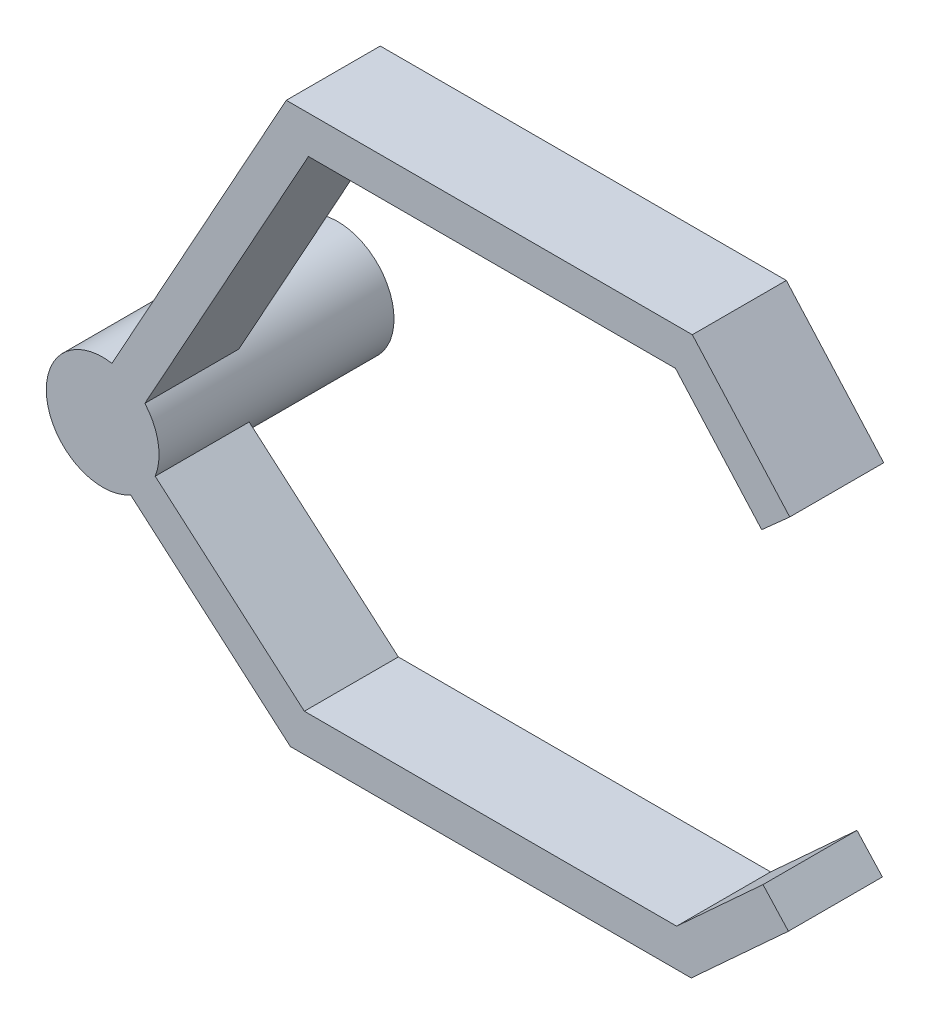
ISO-10303-21;
HEADER;
FILE_DESCRIPTION(('STEP AP214'),'2;1');
FILE_NAME('part.step','',(''),(''),'','','');
FILE_SCHEMA(('AUTOMOTIVE_DESIGN { 1 0 10303 214 1 1 1 1 }'));
ENDSEC;
DATA;
#1=APPLICATION_CONTEXT('core data for automotive mechanical design processes');
#2=APPLICATION_PROTOCOL_DEFINITION('international standard','automotive_design',2000,#1);
#3=PRODUCT_CONTEXT('',#1,'mechanical');
#4=PRODUCT('Part','Part','',(#3));
#5=PRODUCT_RELATED_PRODUCT_CATEGORY('part','',(#4));
#6=PRODUCT_DEFINITION_FORMATION('','',#4);
#7=PRODUCT_DEFINITION_CONTEXT('part definition',#1,'design');
#8=PRODUCT_DEFINITION('design','',#6,#7);
#9=PRODUCT_DEFINITION_SHAPE('','',#8);
#10=(LENGTH_UNIT() NAMED_UNIT(*) SI_UNIT(.MILLI.,.METRE.));
#11=(NAMED_UNIT(*) PLANE_ANGLE_UNIT() SI_UNIT($,.RADIAN.));
#12=(NAMED_UNIT(*) SI_UNIT($,.STERADIAN.) SOLID_ANGLE_UNIT());
#13=UNCERTAINTY_MEASURE_WITH_UNIT(LENGTH_MEASURE(1.E-05),#10,'distance_accuracy_value','');
#14=(GEOMETRIC_REPRESENTATION_CONTEXT(3) GLOBAL_UNCERTAINTY_ASSIGNED_CONTEXT((#13)) GLOBAL_UNIT_ASSIGNED_CONTEXT((#10,
#11,#12)) REPRESENTATION_CONTEXT('',''));
#15=CARTESIAN_POINT('',(0.,0.,0.));
#16=DIRECTION('',(0.,0.,1.));
#17=DIRECTION('',(1.,0.,0.));
#18=AXIS2_PLACEMENT_3D('',#15,#16,#17);
#19=CARTESIAN_POINT('',(0.,0.,-15.));
#20=DIRECTION('',(0.,0.,1.));
#21=DIRECTION('',(1.,0.,0.));
#22=AXIS2_PLACEMENT_3D('',#19,#20,#21);
#23=CYLINDRICAL_SURFACE('',#22,6.);
#24=CARTESIAN_POINT('',(0.,0.,-15.));
#25=DIRECTION('',(0.,0.,1.));
#26=DIRECTION('',(1.,0.,0.));
#27=AXIS2_PLACEMENT_3D('',#24,#25,#26);
#28=CIRCLE('',#27,6.);
#29=CARTESIAN_POINT('',(6.,0.,-15.));
#30=VERTEX_POINT('',#29);
#31=EDGE_CURVE('E241',#30,#30,#28,.T.);
#32=ORIENTED_EDGE('',*,*,#31,.T.);
#33=EDGE_LOOP('',(#32));
#34=FACE_BOUND('',#33,.T.);
#35=CARTESIAN_POINT('',(0.,0.,0.));
#36=DIRECTION('',(0.,0.,1.));
#37=DIRECTION('',(1.,0.,0.));
#38=AXIS2_PLACEMENT_3D('',#35,#36,#37);
#39=CIRCLE('',#38,6.);
#40=CARTESIAN_POINT('',(2.97205993748859,-5.21218377726412,0.));
#41=VERTEX_POINT('',#40);
#42=CARTESIAN_POINT('',(5.58766483466355,-2.1858640615245,0.));
#43=VERTEX_POINT('',#42);
#44=EDGE_CURVE('E363',#41,#43,#39,.T.);
#45=ORIENTED_EDGE('',*,*,#44,.F.);
#46=DIRECTION('',(0.,0.,-1.));
#47=VECTOR('',#46,1.);
#48=CARTESIAN_POINT('',(2.97205993748859,-5.21218377726413,10.));
#49=LINE('',#48,#47);
#50=CARTESIAN_POINT('',(2.97205993748859,-5.21218377726413,10.));
#51=VERTEX_POINT('',#50);
#52=EDGE_CURVE('E304',#51,#41,#49,.T.);
#53=ORIENTED_EDGE('',*,*,#52,.F.);
#54=CARTESIAN_POINT('',(0.,0.,10.));
#55=DIRECTION('',(0.,0.,1.));
#56=DIRECTION('',(1.,0.,0.));
#57=AXIS2_PLACEMENT_3D('',#54,#55,#56);
#58=CIRCLE('',#57,6.);
#59=CARTESIAN_POINT('',(0.988958707477526,5.91793550783585,10.));
#60=VERTEX_POINT('',#59);
#61=EDGE_CURVE('E296',#60,#51,#58,.T.);
#62=ORIENTED_EDGE('',*,*,#61,.F.);
#63=DIRECTION('',(0.,0.,-1.));
#64=VECTOR('',#63,1.);
#65=CARTESIAN_POINT('',(0.988958707477526,5.91793550783585,10.));
#66=LINE('',#65,#64);
#67=CARTESIAN_POINT('',(0.988958707477526,5.91793550783585,0.));
#68=VERTEX_POINT('',#67);
#69=EDGE_CURVE('E181',#60,#68,#66,.T.);
#70=ORIENTED_EDGE('',*,*,#69,.T.);
#71=CARTESIAN_POINT('',(0.,0.,0.));
#72=DIRECTION('',(0.,0.,1.));
#73=DIRECTION('',(1.,0.,0.));
#74=AXIS2_PLACEMENT_3D('',#71,#72,#73);
#75=CIRCLE('',#74,6.);
#76=CARTESIAN_POINT('',(4.48884550867397,3.98123925420936,0.));
#77=VERTEX_POINT('',#76);
#78=EDGE_CURVE('E237',#77,#68,#75,.T.);
#79=ORIENTED_EDGE('',*,*,#78,.F.);
#80=DIRECTION('',(0.,0.,-1.));
#81=VECTOR('',#80,1.);
#82=CARTESIAN_POINT('',(4.48884550867397,3.98123925420936,10.));
#83=LINE('',#82,#81);
#84=CARTESIAN_POINT('',(4.48884550867397,3.98123925420936,10.));
#85=VERTEX_POINT('',#84);
#86=EDGE_CURVE('E12',#85,#77,#83,.T.);
#87=ORIENTED_EDGE('',*,*,#86,.F.);
#88=CARTESIAN_POINT('',(5.58766483466355,-2.1858640615245,10.));
#89=VERTEX_POINT('',#88);
#90=EDGE_CURVE('E300',#89,#85,#58,.T.);
#91=ORIENTED_EDGE('',*,*,#90,.F.);
#92=DIRECTION('',(0.,0.,-1.));
#93=VECTOR('',#92,1.);
#94=CARTESIAN_POINT('',(5.58766483466355,-2.1858640615245,10.));
#95=LINE('',#94,#93);
#96=EDGE_CURVE('E331',#89,#43,#95,.T.);
#97=ORIENTED_EDGE('',*,*,#96,.T.);
#98=EDGE_LOOP('',(#45,#53,#62,#70,#79,#87,#91,#97));
#99=FACE_BOUND('',#98,.T.);
#100=ADVANCED_FACE('F125',(#34,#99),#23,.T.);
#101=CARTESIAN_POINT('',(1.74994340059822,-0.968348126813247,10.));
#102=DIRECTION('',(-0.874971700299112,0.484174063406623,0.));
#103=DIRECTION('',(-0.484174063406623,-0.874971700299112,0.));
#104=AXIS2_PLACEMENT_3D('',#101,#102,#103);
#105=PLANE('',#104);
#106=DIRECTION('',(0.484174063406623,0.874971700299112,0.));
#107=VECTOR('',#106,1.);
#108=CARTESIAN_POINT('',(1.74994340059822,-0.968348126813247,0.));
#109=LINE('',#108,#107);
#110=CARTESIAN_POINT('',(21.8940701741508,35.4349666853925,0.));
#111=VERTEX_POINT('',#110);
#112=EDGE_CURVE('E240',#77,#111,#109,.T.);
#113=ORIENTED_EDGE('',*,*,#112,.T.);
#114=DIRECTION('',(0.,0.,-1.));
#115=VECTOR('',#114,1.);
#116=CARTESIAN_POINT('',(21.8940701741508,35.4349666853925,10.));
#117=LINE('',#116,#115);
#118=CARTESIAN_POINT('',(21.8940701741508,35.4349666853925,10.));
#119=VERTEX_POINT('',#118);
#120=EDGE_CURVE('E134',#119,#111,#117,.T.);
#121=ORIENTED_EDGE('',*,*,#120,.F.);
#122=DIRECTION('',(0.484174063406623,0.874971700299112,0.));
#123=VECTOR('',#122,1.);
#124=CARTESIAN_POINT('',(1.74994340059822,-0.968348126813247,10.));
#125=LINE('',#124,#123);
#126=EDGE_CURVE('E190',#85,#119,#125,.T.);
#127=ORIENTED_EDGE('',*,*,#126,.F.);
#128=ORIENTED_EDGE('',*,*,#86,.T.);
#129=EDGE_LOOP('',(#113,#121,#127,#128));
#130=FACE_BOUND('',#129,.T.);
#131=ADVANCED_FACE('F127',(#130),#105,.F.);
#132=CARTESIAN_POINT('',(0.,35.4349666853925,10.));
#133=DIRECTION('',(0.,1.,0.));
#134=DIRECTION('',(0.,0.,1.));
#135=AXIS2_PLACEMENT_3D('',#132,#133,#134);
#136=PLANE('',#135);
#137=DIRECTION('',(1.,0.,0.));
#138=VECTOR('',#137,1.);
#139=CARTESIAN_POINT('',(0.,35.4349666853925,0.));
#140=LINE('',#139,#138);
#141=CARTESIAN_POINT('',(60.9529553378539,35.4349666853925,0.));
#142=VERTEX_POINT('',#141);
#143=EDGE_CURVE('E244',#111,#142,#140,.T.);
#144=ORIENTED_EDGE('',*,*,#143,.T.);
#145=DIRECTION('',(0.,0.,-1.));
#146=VECTOR('',#145,1.);
#147=CARTESIAN_POINT('',(60.9529553378539,35.4349666853925,10.));
#148=LINE('',#147,#146);
#149=CARTESIAN_POINT('',(60.9529553378539,35.4349666853925,10.));
#150=VERTEX_POINT('',#149);
#151=EDGE_CURVE('E272',#150,#142,#148,.T.);
#152=ORIENTED_EDGE('',*,*,#151,.F.);
#153=DIRECTION('',(1.,0.,0.));
#154=VECTOR('',#153,1.);
#155=CARTESIAN_POINT('',(0.,35.4349666853925,10.));
#156=LINE('',#155,#154);
#157=EDGE_CURVE('E282',#119,#150,#156,.T.);
#158=ORIENTED_EDGE('',*,*,#157,.F.);
#159=ORIENTED_EDGE('',*,*,#120,.T.);
#160=EDGE_LOOP('',(#144,#152,#158,#159));
#161=FACE_BOUND('',#160,.T.);
#162=ADVANCED_FACE('F280',(#161),#136,.F.);
#163=CARTESIAN_POINT('',(51.5503214728992,45.9773137460993,10.));
#164=DIRECTION('',(0.746295434468511,0.665614846958401,0.));
#165=DIRECTION('',(-0.665614846958401,0.746295434468511,0.));
#166=AXIS2_PLACEMENT_3D('',#163,#164,#165);
#167=PLANE('',#166);
#168=DIRECTION('',(0.665614846958401,-0.746295434468511,0.));
#169=VECTOR('',#168,1.);
#170=CARTESIAN_POINT('',(51.5503214728992,45.9773137460993,0.));
#171=LINE('',#170,#169);
#172=CARTESIAN_POINT('',(70.1221280074661,25.1543791467364,0.));
#173=VERTEX_POINT('',#172);
#174=EDGE_CURVE('E247',#142,#173,#171,.T.);
#175=ORIENTED_EDGE('',*,*,#174,.T.);
#176=DIRECTION('',(0.,0.,-1.));
#177=VECTOR('',#176,1.);
#178=CARTESIAN_POINT('',(70.1221280074661,25.1543791467364,10.));
#179=LINE('',#178,#177);
#180=CARTESIAN_POINT('',(70.1221280074661,25.1543791467364,10.));
#181=VERTEX_POINT('',#180);
#182=EDGE_CURVE('E213',#181,#173,#179,.T.);
#183=ORIENTED_EDGE('',*,*,#182,.F.);
#184=DIRECTION('',(0.665614846958401,-0.746295434468511,0.));
#185=VECTOR('',#184,1.);
#186=CARTESIAN_POINT('',(51.5503214728992,45.9773137460993,10.));
#187=LINE('',#186,#185);
#188=EDGE_CURVE('E221',#150,#181,#187,.T.);
#189=ORIENTED_EDGE('',*,*,#188,.F.);
#190=ORIENTED_EDGE('',*,*,#151,.T.);
#191=EDGE_LOOP('',(#175,#183,#189,#190));
#192=FACE_BOUND('',#191,.T.);
#193=ADVANCED_FACE('F289',(#192),#167,.F.);
#194=CARTESIAN_POINT('',(18.5718065345669,-20.8229345993629,10.));
#195=DIRECTION('',(0.665614846958401,-0.746295434468511,0.));
#196=DIRECTION('',(0.746295434468511,0.665614846958401,0.));
#197=AXIS2_PLACEMENT_3D('',#194,#195,#196);
#198=PLANE('',#197);
#199=DIRECTION('',(-0.746295434468511,-0.665614846958401,0.));
#200=VECTOR('',#199,1.);
#201=CARTESIAN_POINT('',(18.5718065345669,-20.8229345993629,0.));
#202=LINE('',#201,#200);
#203=CARTESIAN_POINT('',(73.1073097453401,27.81683853457,0.));
#204=VERTEX_POINT('',#203);
#205=EDGE_CURVE('E207',#204,#173,#202,.T.);
#206=ORIENTED_EDGE('',*,*,#205,.F.);
#207=DIRECTION('',(0.,0.,-1.));
#208=VECTOR('',#207,1.);
#209=CARTESIAN_POINT('',(73.1073097453401,27.81683853457,10.));
#210=LINE('',#209,#208);
#211=CARTESIAN_POINT('',(73.1073097453401,27.81683853457,10.));
#212=VERTEX_POINT('',#211);
#213=EDGE_CURVE('E202',#212,#204,#210,.T.);
#214=ORIENTED_EDGE('',*,*,#213,.F.);
#215=DIRECTION('',(-0.746295434468511,-0.665614846958401,0.));
#216=VECTOR('',#215,1.);
#217=CARTESIAN_POINT('',(18.5718065345669,-20.8229345993629,10.));
#218=LINE('',#217,#216);
#219=EDGE_CURVE('E205',#212,#181,#218,.T.);
#220=ORIENTED_EDGE('',*,*,#219,.T.);
#221=ORIENTED_EDGE('',*,*,#182,.T.);
#222=EDGE_LOOP('',(#206,#214,#220,#221));
#223=FACE_BOUND('',#222,.T.);
#224=ADVANCED_FACE('F204',(#223),#198,.T.);
#225=CARTESIAN_POINT('',(54.5355032107733,48.6397731339329,10.));
#226=DIRECTION('',(0.746295434468511,0.665614846958401,0.));
#227=DIRECTION('',(-0.665614846958401,0.746295434468511,0.));
#228=AXIS2_PLACEMENT_3D('',#225,#226,#227);
#229=PLANE('',#228);
#230=DIRECTION('',(0.665614846958401,-0.746295434468511,0.));
#231=VECTOR('',#230,1.);
#232=CARTESIAN_POINT('',(54.5355032107733,48.6397731339329,0.));
#233=LINE('',#232,#231);
#234=CARTESIAN_POINT('',(62.7451954486606,39.4349666853925,0.));
#235=VERTEX_POINT('',#234);
#236=EDGE_CURVE('E253',#235,#204,#233,.T.);
#237=ORIENTED_EDGE('',*,*,#236,.F.);
#238=DIRECTION('',(0.,0.,-1.));
#239=VECTOR('',#238,1.);
#240=CARTESIAN_POINT('',(62.7451954486606,39.4349666853925,10.));
#241=LINE('',#240,#239);
#242=CARTESIAN_POINT('',(62.7451954486606,39.4349666853925,10.));
#243=VERTEX_POINT('',#242);
#244=EDGE_CURVE('E214',#243,#235,#241,.T.);
#245=ORIENTED_EDGE('',*,*,#244,.F.);
#246=DIRECTION('',(0.665614846958401,-0.746295434468511,0.));
#247=VECTOR('',#246,1.);
#248=CARTESIAN_POINT('',(54.5355032107733,48.6397731339329,10.));
#249=LINE('',#248,#247);
#250=EDGE_CURVE('E219',#243,#212,#249,.T.);
#251=ORIENTED_EDGE('',*,*,#250,.T.);
#252=ORIENTED_EDGE('',*,*,#213,.T.);
#253=EDGE_LOOP('',(#237,#245,#251,#252));
#254=FACE_BOUND('',#253,.T.);
#255=ADVANCED_FACE('F225',(#254),#229,.T.);
#256=CARTESIAN_POINT('',(0.,39.4349666853925,10.));
#257=DIRECTION('',(0.,1.,0.));
#258=DIRECTION('',(0.,0.,1.));
#259=AXIS2_PLACEMENT_3D('',#256,#257,#258);
#260=PLANE('',#259);
#261=DIRECTION('',(1.,0.,0.));
#262=VECTOR('',#261,1.);
#263=CARTESIAN_POINT('',(0.,39.4349666853925,0.));
#264=LINE('',#263,#262);
#265=CARTESIAN_POINT('',(19.5359324816196,39.4349666853925,0.));
#266=VERTEX_POINT('',#265);
#267=EDGE_CURVE('E256',#266,#235,#264,.T.);
#268=ORIENTED_EDGE('',*,*,#267,.F.);
#269=DIRECTION('',(0.,0.,-1.));
#270=VECTOR('',#269,1.);
#271=CARTESIAN_POINT('',(19.5359324816196,39.4349666853925,10.));
#272=LINE('',#271,#270);
#273=CARTESIAN_POINT('',(19.5359324816196,39.4349666853925,10.));
#274=VERTEX_POINT('',#273);
#275=EDGE_CURVE('E150',#274,#266,#272,.T.);
#276=ORIENTED_EDGE('',*,*,#275,.F.);
#277=DIRECTION('',(1.,0.,0.));
#278=VECTOR('',#277,1.);
#279=CARTESIAN_POINT('',(0.,39.4349666853925,10.));
#280=LINE('',#279,#278);
#281=EDGE_CURVE('E227',#274,#243,#280,.T.);
#282=ORIENTED_EDGE('',*,*,#281,.T.);
#283=ORIENTED_EDGE('',*,*,#244,.T.);
#284=EDGE_LOOP('',(#268,#276,#282,#283));
#285=FACE_BOUND('',#284,.T.);
#286=ADVANCED_FACE('F467',(#285),#260,.T.);
#287=CARTESIAN_POINT('',(-1.74994340059822,0.968348126813247,10.));
#288=DIRECTION('',(-0.874971700299112,0.484174063406623,0.));
#289=DIRECTION('',(-0.484174063406623,-0.874971700299112,0.));
#290=AXIS2_PLACEMENT_3D('',#287,#288,#289);
#291=PLANE('',#290);
#292=DIRECTION('',(0.484174063406623,0.874971700299112,0.));
#293=VECTOR('',#292,1.);
#294=CARTESIAN_POINT('',(-1.74994340059822,0.968348126813247,0.));
#295=LINE('',#294,#293);
#296=EDGE_CURVE('E260',#68,#266,#295,.T.);
#297=ORIENTED_EDGE('',*,*,#296,.F.);
#298=ORIENTED_EDGE('',*,*,#69,.F.);
#299=DIRECTION('',(0.484174063406623,0.874971700299112,0.));
#300=VECTOR('',#299,1.);
#301=CARTESIAN_POINT('',(-1.74994340059822,0.968348126813247,10.));
#302=LINE('',#301,#300);
#303=EDGE_CURVE('E230',#60,#274,#302,.T.);
#304=ORIENTED_EDGE('',*,*,#303,.T.);
#305=ORIENTED_EDGE('',*,*,#275,.T.);
#306=EDGE_LOOP('',(#297,#298,#304,#305));
#307=FACE_BOUND('',#306,.T.);
#308=ADVANCED_FACE('F462',(#307),#291,.T.);
#309=CARTESIAN_POINT('',(0.,0.,10.));
#310=DIRECTION('',(0.,0.,1.));
#311=DIRECTION('',(1.,0.,0.));
#312=AXIS2_PLACEMENT_3D('',#309,#310,#311);
#313=PLANE('',#312);
#314=ORIENTED_EDGE('',*,*,#303,.F.);
#315=ORIENTED_EDGE('',*,*,#61,.T.);
#316=DIRECTION('',(0.756579928934906,-0.65390122429374,0.));
#317=VECTOR('',#316,1.);
#318=CARTESIAN_POINT('',(-1.30780244858748,-1.51315985786981,10.));
#319=LINE('',#318,#317);
#320=CARTESIAN_POINT('',(19.9704849941591,-19.9036797191008,10.));
#321=VERTEX_POINT('',#320);
#322=EDGE_CURVE('E340',#51,#321,#319,.T.);
#323=ORIENTED_EDGE('',*,*,#322,.T.);
#324=DIRECTION('',(1.,0.,0.));
#325=VECTOR('',#324,1.);
#326=CARTESIAN_POINT('',(0.,-19.9036797191008,10.));
#327=LINE('',#326,#325);
#328=CARTESIAN_POINT('',(62.6270427743662,-19.9036797191008,10.));
#329=VERTEX_POINT('',#328);
#330=EDGE_CURVE('E385',#321,#329,#327,.T.);
#331=ORIENTED_EDGE('',*,*,#330,.T.);
#332=DIRECTION('',(0.737154140200742,0.675724628517346,0.));
#333=VECTOR('',#332,1.);
#334=CARTESIAN_POINT('',(38.5100298061117,-42.0109416066674,10.));
#335=LINE('',#334,#333);
#336=CARTESIAN_POINT('',(72.9661681334378,-10.4261481399519,10.));
#337=VERTEX_POINT('',#336);
#338=EDGE_CURVE('E381',#329,#337,#335,.T.);
#339=ORIENTED_EDGE('',*,*,#338,.T.);
#340=DIRECTION('',(0.675724628517346,-0.737154140200742,0.));
#341=VECTOR('',#340,1.);
#342=CARTESIAN_POINT('',(34.4561383273261,31.5847934667155,10.));
#343=LINE('',#342,#341);
#344=CARTESIAN_POINT('',(70.2632696193684,-7.4775315791489,10.));
#345=VERTEX_POINT('',#344);
#346=EDGE_CURVE('E377',#345,#337,#343,.T.);
#347=ORIENTED_EDGE('',*,*,#346,.F.);
#348=DIRECTION('',(0.737154140200741,0.675724628517346,0.));
#349=VECTOR('',#348,1.);
#350=CARTESIAN_POINT('',(35.8071312920424,-39.0623250458644,10.));
#351=LINE('',#350,#349);
#352=CARTESIAN_POINT('',(61.0711080121482,-15.9036797191008,10.));
#353=VERTEX_POINT('',#352);
#354=EDGE_CURVE('E373',#353,#345,#351,.T.);
#355=ORIENTED_EDGE('',*,*,#354,.F.);
#356=DIRECTION('',(1.,0.,0.));
#357=VECTOR('',#356,1.);
#358=CARTESIAN_POINT('',(0.,-15.9036797191008,10.));
#359=LINE('',#358,#357);
#360=CARTESIAN_POINT('',(21.4595176616113,-15.9036797191008,10.));
#361=VERTEX_POINT('',#360);
#362=EDGE_CURVE('E369',#361,#353,#359,.T.);
#363=ORIENTED_EDGE('',*,*,#362,.F.);
#364=DIRECTION('',(0.756579928934906,-0.65390122429374,0.));
#365=VECTOR('',#364,1.);
#366=CARTESIAN_POINT('',(1.30780244858748,1.51315985786981,10.));
#367=LINE('',#366,#365);
#368=EDGE_CURVE('E335',#89,#361,#367,.T.);
#369=ORIENTED_EDGE('',*,*,#368,.F.);
#370=ORIENTED_EDGE('',*,*,#90,.T.);
#371=ORIENTED_EDGE('',*,*,#126,.T.);
#372=ORIENTED_EDGE('',*,*,#157,.T.);
#373=ORIENTED_EDGE('',*,*,#188,.T.);
#374=ORIENTED_EDGE('',*,*,#219,.F.);
#375=ORIENTED_EDGE('',*,*,#250,.F.);
#376=ORIENTED_EDGE('',*,*,#281,.F.);
#377=EDGE_LOOP('',(#314,#315,#323,#331,#339,#347,#355,#363,#369,#370,#371,#372,#373,#374,#375,#376));
#378=FACE_BOUND('',#377,.T.);
#379=ADVANCED_FACE('F218',(#378),#313,.T.);
#380=CARTESIAN_POINT('',(0.,0.,0.));
#381=DIRECTION('',(0.,0.,1.));
#382=DIRECTION('',(1.,0.,0.));
#383=AXIS2_PLACEMENT_3D('',#380,#381,#382);
#384=PLANE('',#383);
#385=ORIENTED_EDGE('',*,*,#78,.T.);
#386=ORIENTED_EDGE('',*,*,#296,.T.);
#387=ORIENTED_EDGE('',*,*,#267,.T.);
#388=ORIENTED_EDGE('',*,*,#236,.T.);
#389=ORIENTED_EDGE('',*,*,#205,.T.);
#390=ORIENTED_EDGE('',*,*,#174,.F.);
#391=ORIENTED_EDGE('',*,*,#143,.F.);
#392=ORIENTED_EDGE('',*,*,#112,.F.);
#393=EDGE_LOOP('',(#385,#386,#387,#388,#389,#390,#391,#392));
#394=FACE_BOUND('',#393,.T.);
#395=ADVANCED_FACE('F287',(#394),#384,.F.);
#396=CARTESIAN_POINT('',(0.,0.,-15.));
#397=DIRECTION('',(0.,0.,1.));
#398=DIRECTION('',(1.,0.,0.));
#399=AXIS2_PLACEMENT_3D('',#396,#397,#398);
#400=PLANE('',#399);
#401=ORIENTED_EDGE('',*,*,#31,.F.);
#402=EDGE_LOOP('',(#401));
#403=FACE_BOUND('',#402,.T.);
#404=ADVANCED_FACE('F458',(#403),#400,.F.);
#405=CARTESIAN_POINT('',(-1.30780244858748,-1.51315985786981,10.));
#406=DIRECTION('',(0.65390122429374,0.756579928934906,0.));
#407=DIRECTION('',(-0.756579928934906,0.65390122429374,0.));
#408=AXIS2_PLACEMENT_3D('',#405,#406,#407);
#409=PLANE('',#408);
#410=DIRECTION('',(0.756579928934906,-0.65390122429374,0.));
#411=VECTOR('',#410,1.);
#412=CARTESIAN_POINT('',(-1.30780244858748,-1.51315985786981,0.));
#413=LINE('',#412,#411);
#414=CARTESIAN_POINT('',(19.9704849941591,-19.9036797191008,0.));
#415=VERTEX_POINT('',#414);
#416=EDGE_CURVE('E141',#41,#415,#413,.T.);
#417=ORIENTED_EDGE('',*,*,#416,.T.);
#418=DIRECTION('',(0.,0.,-1.));
#419=VECTOR('',#418,1.);
#420=CARTESIAN_POINT('',(19.9704849941591,-19.9036797191008,10.));
#421=LINE('',#420,#419);
#422=EDGE_CURVE('E307',#321,#415,#421,.T.);
#423=ORIENTED_EDGE('',*,*,#422,.F.);
#424=ORIENTED_EDGE('',*,*,#322,.F.);
#425=ORIENTED_EDGE('',*,*,#52,.T.);
#426=EDGE_LOOP('',(#417,#423,#424,#425));
#427=FACE_BOUND('',#426,.T.);
#428=ADVANCED_FACE('F401',(#427),#409,.F.);
#429=CARTESIAN_POINT('',(0.,-19.9036797191008,10.));
#430=DIRECTION('',(0.,1.,0.));
#431=DIRECTION('',(0.,0.,1.));
#432=AXIS2_PLACEMENT_3D('',#429,#430,#431);
#433=PLANE('',#432);
#434=DIRECTION('',(1.,0.,0.));
#435=VECTOR('',#434,1.);
#436=CARTESIAN_POINT('',(0.,-19.9036797191008,0.));
#437=LINE('',#436,#435);
#438=CARTESIAN_POINT('',(62.6270427743662,-19.9036797191008,0.));
#439=VERTEX_POINT('',#438);
#440=EDGE_CURVE('E357',#415,#439,#437,.T.);
#441=ORIENTED_EDGE('',*,*,#440,.T.);
#442=DIRECTION('',(0.,0.,-1.));
#443=VECTOR('',#442,1.);
#444=CARTESIAN_POINT('',(62.6270427743662,-19.9036797191008,10.));
#445=LINE('',#444,#443);
#446=EDGE_CURVE('E311',#329,#439,#445,.T.);
#447=ORIENTED_EDGE('',*,*,#446,.F.);
#448=ORIENTED_EDGE('',*,*,#330,.F.);
#449=ORIENTED_EDGE('',*,*,#422,.T.);
#450=EDGE_LOOP('',(#441,#447,#448,#449));
#451=FACE_BOUND('',#450,.T.);
#452=ADVANCED_FACE('F404',(#451),#433,.F.);
#453=CARTESIAN_POINT('',(38.5100298061117,-42.0109416066674,10.));
#454=DIRECTION('',(-0.675724628517346,0.737154140200742,0.));
#455=DIRECTION('',(-0.737154140200742,-0.675724628517346,0.));
#456=AXIS2_PLACEMENT_3D('',#453,#454,#455);
#457=PLANE('',#456);
#458=DIRECTION('',(0.737154140200742,0.675724628517346,0.));
#459=VECTOR('',#458,1.);
#460=CARTESIAN_POINT('',(38.5100298061117,-42.0109416066674,0.));
#461=LINE('',#460,#459);
#462=CARTESIAN_POINT('',(72.9661681334378,-10.4261481399519,0.));
#463=VERTEX_POINT('',#462);
#464=EDGE_CURVE('E353',#439,#463,#461,.T.);
#465=ORIENTED_EDGE('',*,*,#464,.T.);
#466=DIRECTION('',(0.,0.,-1.));
#467=VECTOR('',#466,1.);
#468=CARTESIAN_POINT('',(72.9661681334378,-10.4261481399519,10.));
#469=LINE('',#468,#467);
#470=EDGE_CURVE('E315',#337,#463,#469,.T.);
#471=ORIENTED_EDGE('',*,*,#470,.F.);
#472=ORIENTED_EDGE('',*,*,#338,.F.);
#473=ORIENTED_EDGE('',*,*,#446,.T.);
#474=EDGE_LOOP('',(#465,#471,#472,#473));
#475=FACE_BOUND('',#474,.T.);
#476=ADVANCED_FACE('F412',(#475),#457,.F.);
#477=CARTESIAN_POINT('',(34.4561383273261,31.5847934667155,10.));
#478=DIRECTION('',(0.737154140200742,0.675724628517346,0.));
#479=DIRECTION('',(-0.675724628517346,0.737154140200742,0.));
#480=AXIS2_PLACEMENT_3D('',#477,#478,#479);
#481=PLANE('',#480);
#482=DIRECTION('',(0.675724628517346,-0.737154140200742,0.));
#483=VECTOR('',#482,1.);
#484=CARTESIAN_POINT('',(34.4561383273261,31.5847934667155,0.));
#485=LINE('',#484,#483);
#486=CARTESIAN_POINT('',(70.2632696193684,-7.4775315791489,0.));
#487=VERTEX_POINT('',#486);
#488=EDGE_CURVE('E349',#487,#463,#485,.T.);
#489=ORIENTED_EDGE('',*,*,#488,.F.);
#490=DIRECTION('',(0.,0.,-1.));
#491=VECTOR('',#490,1.);
#492=CARTESIAN_POINT('',(70.2632696193684,-7.4775315791489,10.));
#493=LINE('',#492,#491);
#494=EDGE_CURVE('E319',#345,#487,#493,.T.);
#495=ORIENTED_EDGE('',*,*,#494,.F.);
#496=ORIENTED_EDGE('',*,*,#346,.T.);
#497=ORIENTED_EDGE('',*,*,#470,.T.);
#498=EDGE_LOOP('',(#489,#495,#496,#497));
#499=FACE_BOUND('',#498,.T.);
#500=ADVANCED_FACE('F527',(#499),#481,.T.);
#501=CARTESIAN_POINT('',(35.8071312920424,-39.0623250458644,10.));
#502=DIRECTION('',(-0.675724628517346,0.737154140200741,0.));
#503=DIRECTION('',(-0.737154140200741,-0.675724628517346,0.));
#504=AXIS2_PLACEMENT_3D('',#501,#502,#503);
#505=PLANE('',#504);
#506=DIRECTION('',(0.737154140200741,0.675724628517346,0.));
#507=VECTOR('',#506,1.);
#508=CARTESIAN_POINT('',(35.8071312920424,-39.0623250458644,0.));
#509=LINE('',#508,#507);
#510=CARTESIAN_POINT('',(61.0711080121482,-15.9036797191008,0.));
#511=VERTEX_POINT('',#510);
#512=EDGE_CURVE('E345',#511,#487,#509,.T.);
#513=ORIENTED_EDGE('',*,*,#512,.F.);
#514=DIRECTION('',(0.,0.,-1.));
#515=VECTOR('',#514,1.);
#516=CARTESIAN_POINT('',(61.0711080121482,-15.9036797191008,10.));
#517=LINE('',#516,#515);
#518=EDGE_CURVE('E323',#353,#511,#517,.T.);
#519=ORIENTED_EDGE('',*,*,#518,.F.);
#520=ORIENTED_EDGE('',*,*,#354,.T.);
#521=ORIENTED_EDGE('',*,*,#494,.T.);
#522=EDGE_LOOP('',(#513,#519,#520,#521));
#523=FACE_BOUND('',#522,.T.);
#524=ADVANCED_FACE('F534',(#523),#505,.T.);
#525=CARTESIAN_POINT('',(0.,-15.9036797191008,10.));
#526=DIRECTION('',(0.,1.,0.));
#527=DIRECTION('',(0.,0.,1.));
#528=AXIS2_PLACEMENT_3D('',#525,#526,#527);
#529=PLANE('',#528);
#530=DIRECTION('',(1.,0.,0.));
#531=VECTOR('',#530,1.);
#532=CARTESIAN_POINT('',(0.,-15.9036797191008,0.));
#533=LINE('',#532,#531);
#534=CARTESIAN_POINT('',(21.4595176616113,-15.9036797191008,0.));
#535=VERTEX_POINT('',#534);
#536=EDGE_CURVE('E341',#535,#511,#533,.T.);
#537=ORIENTED_EDGE('',*,*,#536,.F.);
#538=DIRECTION('',(0.,0.,-1.));
#539=VECTOR('',#538,1.);
#540=CARTESIAN_POINT('',(21.4595176616113,-15.9036797191008,10.));
#541=LINE('',#540,#539);
#542=EDGE_CURVE('E327',#361,#535,#541,.T.);
#543=ORIENTED_EDGE('',*,*,#542,.F.);
#544=ORIENTED_EDGE('',*,*,#362,.T.);
#545=ORIENTED_EDGE('',*,*,#518,.T.);
#546=EDGE_LOOP('',(#537,#543,#544,#545));
#547=FACE_BOUND('',#546,.T.);
#548=ADVANCED_FACE('F542',(#547),#529,.T.);
#549=CARTESIAN_POINT('',(1.30780244858748,1.51315985786981,10.));
#550=DIRECTION('',(0.65390122429374,0.756579928934906,0.));
#551=DIRECTION('',(-0.756579928934906,0.65390122429374,0.));
#552=AXIS2_PLACEMENT_3D('',#549,#550,#551);
#553=PLANE('',#552);
#554=DIRECTION('',(0.756579928934906,-0.65390122429374,0.));
#555=VECTOR('',#554,1.);
#556=CARTESIAN_POINT('',(1.30780244858748,1.51315985786981,0.));
#557=LINE('',#556,#555);
#558=EDGE_CURVE('E336',#43,#535,#557,.T.);
#559=ORIENTED_EDGE('',*,*,#558,.F.);
#560=ORIENTED_EDGE('',*,*,#96,.F.);
#561=ORIENTED_EDGE('',*,*,#368,.T.);
#562=ORIENTED_EDGE('',*,*,#542,.T.);
#563=EDGE_LOOP('',(#559,#560,#561,#562));
#564=FACE_BOUND('',#563,.T.);
#565=ADVANCED_FACE('F550',(#564),#553,.T.);
#566=CARTESIAN_POINT('',(0.,0.,0.));
#567=DIRECTION('',(0.,0.,1.));
#568=DIRECTION('',(1.,0.,0.));
#569=AXIS2_PLACEMENT_3D('',#566,#567,#568);
#570=PLANE('',#569);
#571=ORIENTED_EDGE('',*,*,#44,.T.);
#572=ORIENTED_EDGE('',*,*,#558,.T.);
#573=ORIENTED_EDGE('',*,*,#536,.T.);
#574=ORIENTED_EDGE('',*,*,#512,.T.);
#575=ORIENTED_EDGE('',*,*,#488,.T.);
#576=ORIENTED_EDGE('',*,*,#464,.F.);
#577=ORIENTED_EDGE('',*,*,#440,.F.);
#578=ORIENTED_EDGE('',*,*,#416,.F.);
#579=EDGE_LOOP('',(#571,#572,#573,#574,#575,#576,#577,#578));
#580=FACE_BOUND('',#579,.T.);
#581=ADVANCED_FACE('F558',(#580),#570,.F.);
#582=CLOSED_SHELL('',(#100,#131,#162,#193,#224,#255,#286,#308,#379,#395,#404,#428,#452,#476,
#500,#524,#548,#565,#581));
#583=MANIFOLD_SOLID_BREP('B2',#582);
#584=ADVANCED_BREP_SHAPE_REPRESENTATION('',(#18,#583),#14);
#585=SHAPE_DEFINITION_REPRESENTATION(#9,#584);
ENDSEC;
END-ISO-10303-21;
